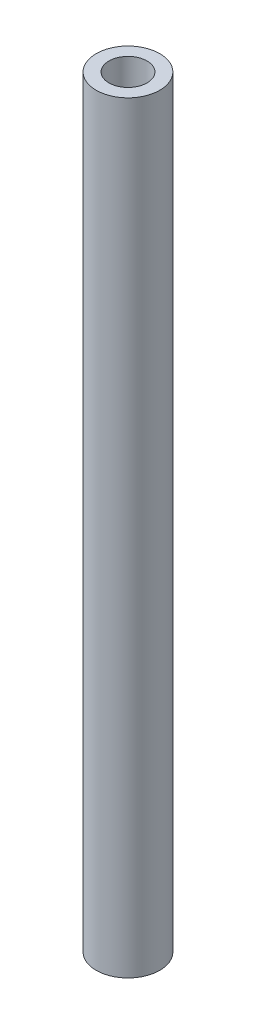
ISO-10303-21;
HEADER;
FILE_DESCRIPTION(('STEP AP214'),'2;1');
FILE_NAME('part.step','',(''),(''),'','','');
FILE_SCHEMA(('AUTOMOTIVE_DESIGN { 1 0 10303 214 1 1 1 1 }'));
ENDSEC;
DATA;
#1=APPLICATION_CONTEXT('core data for automotive mechanical design processes');
#2=APPLICATION_PROTOCOL_DEFINITION('international standard','automotive_design',2000,#1);
#3=PRODUCT_CONTEXT('',#1,'mechanical');
#4=PRODUCT('Part','Part','',(#3));
#5=PRODUCT_RELATED_PRODUCT_CATEGORY('part','',(#4));
#6=PRODUCT_DEFINITION_FORMATION('','',#4);
#7=PRODUCT_DEFINITION_CONTEXT('part definition',#1,'design');
#8=PRODUCT_DEFINITION('design','',#6,#7);
#9=PRODUCT_DEFINITION_SHAPE('','',#8);
#10=(LENGTH_UNIT() NAMED_UNIT(*) SI_UNIT(.MILLI.,.METRE.));
#11=(NAMED_UNIT(*) PLANE_ANGLE_UNIT() SI_UNIT($,.RADIAN.));
#12=(NAMED_UNIT(*) SI_UNIT($,.STERADIAN.) SOLID_ANGLE_UNIT());
#13=UNCERTAINTY_MEASURE_WITH_UNIT(LENGTH_MEASURE(1.E-05),#10,'distance_accuracy_value','');
#14=(GEOMETRIC_REPRESENTATION_CONTEXT(3) GLOBAL_UNCERTAINTY_ASSIGNED_CONTEXT((#13)) GLOBAL_UNIT_ASSIGNED_CONTEXT((#10,
#11,#12)) REPRESENTATION_CONTEXT('',''));
#15=CARTESIAN_POINT('',(0.,0.,0.));
#16=DIRECTION('',(0.,0.,1.));
#17=DIRECTION('',(1.,0.,0.));
#18=AXIS2_PLACEMENT_3D('',#15,#16,#17);
#19=CARTESIAN_POINT('',(0.,60.,0.));
#20=DIRECTION('',(0.,-1.,0.));
#21=DIRECTION('',(0.,0.,-1.));
#22=AXIS2_PLACEMENT_3D('',#19,#20,#21);
#23=CYLINDRICAL_SURFACE('',#22,2.5);
#24=CARTESIAN_POINT('',(0.,60.,0.));
#25=DIRECTION('',(0.,1.,0.));
#26=DIRECTION('',(0.,0.,1.));
#27=AXIS2_PLACEMENT_3D('',#24,#25,#26);
#28=CIRCLE('',#27,2.5);
#29=CARTESIAN_POINT('',(0.,60.,2.5));
#30=VERTEX_POINT('',#29);
#31=EDGE_CURVE('E10',#30,#30,#28,.T.);
#32=ORIENTED_EDGE('',*,*,#31,.F.);
#33=EDGE_LOOP('',(#32));
#34=FACE_BOUND('',#33,.T.);
#35=CARTESIAN_POINT('',(0.,0.,0.));
#36=DIRECTION('',(0.,1.,0.));
#37=DIRECTION('',(0.,0.,1.));
#38=AXIS2_PLACEMENT_3D('',#35,#36,#37);
#39=CIRCLE('',#38,2.5);
#40=CARTESIAN_POINT('',(0.,0.,2.5));
#41=VERTEX_POINT('',#40);
#42=EDGE_CURVE('E40',#41,#41,#39,.T.);
#43=ORIENTED_EDGE('',*,*,#42,.T.);
#44=EDGE_LOOP('',(#43));
#45=FACE_BOUND('',#44,.T.);
#46=ADVANCED_FACE('F37',(#34,#45),#23,.T.);
#47=CARTESIAN_POINT('',(0.,60.,0.));
#48=DIRECTION('',(0.,1.,0.));
#49=DIRECTION('',(0.,0.,1.));
#50=AXIS2_PLACEMENT_3D('',#47,#48,#49);
#51=PLANE('',#50);
#52=CARTESIAN_POINT('',(0.,60.,0.));
#53=DIRECTION('',(0.,1.,0.));
#54=DIRECTION('',(0.,0.,1.));
#55=AXIS2_PLACEMENT_3D('',#52,#53,#54);
#56=CIRCLE('',#55,1.5);
#57=CARTESIAN_POINT('',(0.,60.,1.5));
#58=VERTEX_POINT('',#57);
#59=EDGE_CURVE('E51',#58,#58,#56,.T.);
#60=ORIENTED_EDGE('',*,*,#59,.F.);
#61=EDGE_LOOP('',(#60));
#62=FACE_BOUND('',#61,.T.);
#63=ORIENTED_EDGE('',*,*,#31,.T.);
#64=EDGE_LOOP('',(#63));
#65=FACE_BOUND('',#64,.T.);
#66=ADVANCED_FACE('F68',(#62,#65),#51,.T.);
#67=CARTESIAN_POINT('',(0.,0.,0.));
#68=DIRECTION('',(0.,1.,0.));
#69=DIRECTION('',(0.,0.,1.));
#70=AXIS2_PLACEMENT_3D('',#67,#68,#69);
#71=PLANE('',#70);
#72=CARTESIAN_POINT('',(0.,0.,0.));
#73=DIRECTION('',(0.,1.,0.));
#74=DIRECTION('',(0.,0.,1.));
#75=AXIS2_PLACEMENT_3D('',#72,#73,#74);
#76=CIRCLE('',#75,1.5);
#77=CARTESIAN_POINT('',(0.,0.,1.5));
#78=VERTEX_POINT('',#77);
#79=EDGE_CURVE('E49',#78,#78,#76,.T.);
#80=ORIENTED_EDGE('',*,*,#79,.T.);
#81=EDGE_LOOP('',(#80));
#82=FACE_BOUND('',#81,.T.);
#83=ORIENTED_EDGE('',*,*,#42,.F.);
#84=EDGE_LOOP('',(#83));
#85=FACE_BOUND('',#84,.T.);
#86=ADVANCED_FACE('F59',(#82,#85),#71,.F.);
#87=CARTESIAN_POINT('',(0.,0.,0.));
#88=DIRECTION('',(0.,1.,0.));
#89=DIRECTION('',(0.,0.,1.));
#90=AXIS2_PLACEMENT_3D('',#87,#88,#89);
#91=CYLINDRICAL_SURFACE('',#90,1.5);
#92=ORIENTED_EDGE('',*,*,#79,.F.);
#93=EDGE_LOOP('',(#92));
#94=FACE_BOUND('',#93,.T.);
#95=ORIENTED_EDGE('',*,*,#59,.T.);
#96=EDGE_LOOP('',(#95));
#97=FACE_BOUND('',#96,.T.);
#98=ADVANCED_FACE('F62',(#94,#97),#91,.F.);
#99=CLOSED_SHELL('',(#46,#66,#86,#98));
#100=MANIFOLD_SOLID_BREP('B2',#99);
#101=ADVANCED_BREP_SHAPE_REPRESENTATION('',(#18,#100),#14);
#102=SHAPE_DEFINITION_REPRESENTATION(#9,#101);
ENDSEC;
END-ISO-10303-21;
